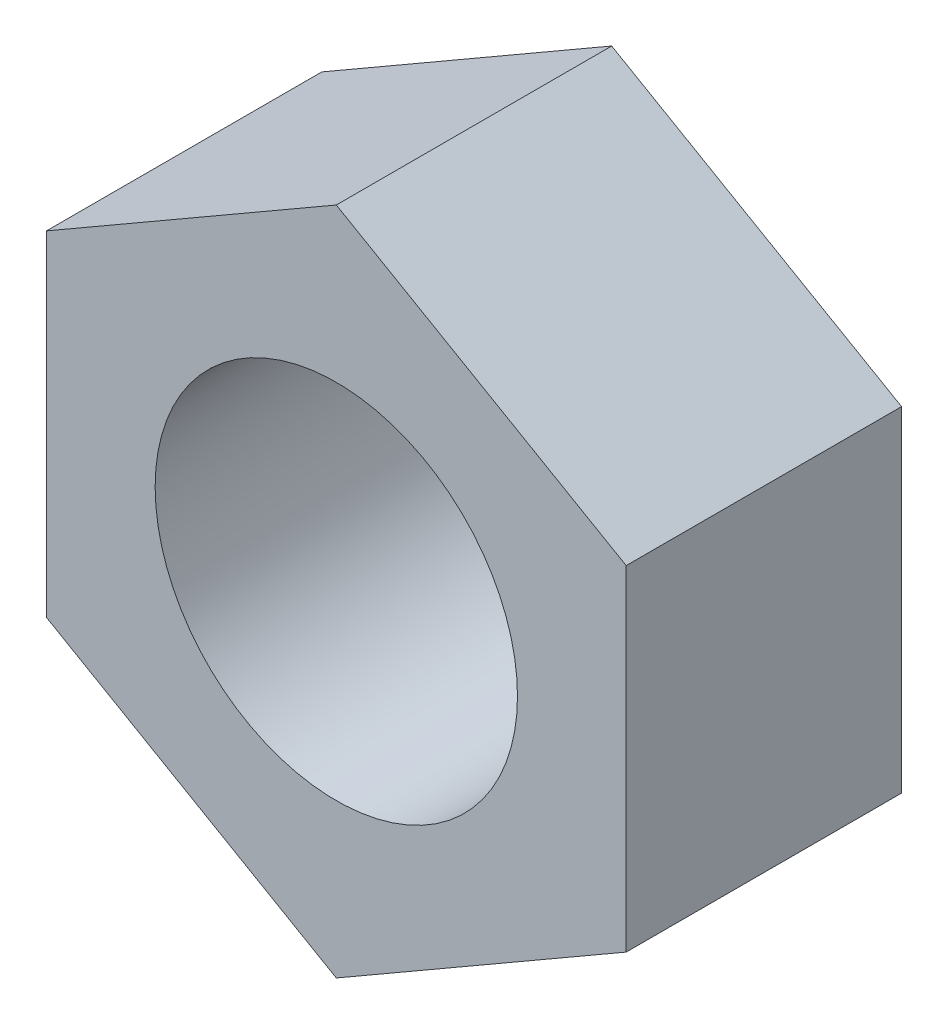
ISO-10303-21;
HEADER;
FILE_DESCRIPTION(('STEP AP214'),'2;1');
FILE_NAME('part.step','',(''),(''),'','','');
FILE_SCHEMA(('AUTOMOTIVE_DESIGN { 1 0 10303 214 1 1 1 1 }'));
ENDSEC;
DATA;
#1=APPLICATION_CONTEXT('core data for automotive mechanical design processes');
#2=APPLICATION_PROTOCOL_DEFINITION('international standard','automotive_design',2000,#1);
#3=PRODUCT_CONTEXT('',#1,'mechanical');
#4=PRODUCT('Part','Part','',(#3));
#5=PRODUCT_RELATED_PRODUCT_CATEGORY('part','',(#4));
#6=PRODUCT_DEFINITION_FORMATION('','',#4);
#7=PRODUCT_DEFINITION_CONTEXT('part definition',#1,'design');
#8=PRODUCT_DEFINITION('design','',#6,#7);
#9=PRODUCT_DEFINITION_SHAPE('','',#8);
#10=(LENGTH_UNIT() NAMED_UNIT(*) SI_UNIT(.MILLI.,.METRE.));
#11=(NAMED_UNIT(*) PLANE_ANGLE_UNIT() SI_UNIT($,.RADIAN.));
#12=(NAMED_UNIT(*) SI_UNIT($,.STERADIAN.) SOLID_ANGLE_UNIT());
#13=UNCERTAINTY_MEASURE_WITH_UNIT(LENGTH_MEASURE(1.E-05),#10,'distance_accuracy_value','');
#14=(GEOMETRIC_REPRESENTATION_CONTEXT(3) GLOBAL_UNCERTAINTY_ASSIGNED_CONTEXT((#13)) GLOBAL_UNIT_ASSIGNED_CONTEXT((#10,
#11,#12)) REPRESENTATION_CONTEXT('',''));
#15=CARTESIAN_POINT('',(0.,0.,0.));
#16=DIRECTION('',(0.,0.,1.));
#17=DIRECTION('',(1.,0.,0.));
#18=AXIS2_PLACEMENT_3D('',#15,#16,#17);
#19=CARTESIAN_POINT('',(0.,0.,3.8));
#20=DIRECTION('',(0.,0.,1.));
#21=DIRECTION('',(1.,0.,0.));
#22=AXIS2_PLACEMENT_3D('',#19,#20,#21);
#23=PLANE('',#22);
#24=DIRECTION('',(-0.866025403784441,0.499999999999995,0.));
#25=VECTOR('',#24,1.);
#26=CARTESIAN_POINT('',(3.99999999999998,2.30940107675855,3.8));
#27=LINE('',#26,#25);
#28=CARTESIAN_POINT('',(3.99999999999998,2.30940107675855,3.8));
#29=VERTEX_POINT('',#28);
#30=CARTESIAN_POINT('',(0.,4.61880215351701,3.8));
#31=VERTEX_POINT('',#30);
#32=EDGE_CURVE('E148',#29,#31,#27,.T.);
#33=ORIENTED_EDGE('',*,*,#32,.T.);
#34=DIRECTION('',(-0.866025403784438,-0.500000000000001,0.));
#35=VECTOR('',#34,1.);
#36=CARTESIAN_POINT('',(0.,4.61880215351701,3.8));
#37=LINE('',#36,#35);
#38=CARTESIAN_POINT('',(-4.00000000000001,2.3094010767585,3.8));
#39=VERTEX_POINT('',#38);
#40=EDGE_CURVE('E94',#31,#39,#37,.T.);
#41=ORIENTED_EDGE('',*,*,#40,.T.);
#42=DIRECTION('',(0.,-1.,0.));
#43=VECTOR('',#42,1.);
#44=CARTESIAN_POINT('',(-4.00000000000001,2.3094010767585,3.8));
#45=LINE('',#44,#43);
#46=CARTESIAN_POINT('',(-3.99999999999999,-2.30940107675852,3.8));
#47=VERTEX_POINT('',#46);
#48=EDGE_CURVE('E107',#39,#47,#45,.T.);
#49=ORIENTED_EDGE('',*,*,#48,.T.);
#50=DIRECTION('',(0.866025403784441,-0.499999999999995,0.));
#51=VECTOR('',#50,1.);
#52=CARTESIAN_POINT('',(-3.99999999999999,-2.30940107675852,3.8));
#53=LINE('',#52,#51);
#54=CARTESIAN_POINT('',(0.,-4.61880215351701,3.8));
#55=VERTEX_POINT('',#54);
#56=EDGE_CURVE('E101',#47,#55,#53,.T.);
#57=ORIENTED_EDGE('',*,*,#56,.T.);
#58=DIRECTION('',(0.866025403784434,0.500000000000007,0.));
#59=VECTOR('',#58,1.);
#60=CARTESIAN_POINT('',(0.,-4.61880215351701,3.8));
#61=LINE('',#60,#59);
#62=CARTESIAN_POINT('',(4.00000000000002,-2.30940107675847,3.8));
#63=VERTEX_POINT('',#62);
#64=EDGE_CURVE('E105',#55,#63,#61,.T.);
#65=ORIENTED_EDGE('',*,*,#64,.T.);
#66=DIRECTION('',(0.,1.,0.));
#67=VECTOR('',#66,1.);
#68=CARTESIAN_POINT('',(4.00000000000002,-2.30940107675847,3.8));
#69=LINE('',#68,#67);
#70=EDGE_CURVE('E57',#63,#29,#69,.T.);
#71=ORIENTED_EDGE('',*,*,#70,.T.);
#72=EDGE_LOOP('',(#33,#41,#49,#57,#65,#71));
#73=FACE_BOUND('',#72,.T.);
#74=CARTESIAN_POINT('',(0.,0.,3.8));
#75=DIRECTION('',(0.,0.,1.));
#76=DIRECTION('',(1.,0.,0.));
#77=AXIS2_PLACEMENT_3D('',#74,#75,#76);
#78=CIRCLE('',#77,2.5);
#79=CARTESIAN_POINT('',(2.5,0.,3.8));
#80=VERTEX_POINT('',#79);
#81=EDGE_CURVE('E137',#80,#80,#78,.T.);
#82=ORIENTED_EDGE('',*,*,#81,.F.);
#83=EDGE_LOOP('',(#82));
#84=FACE_BOUND('',#83,.T.);
#85=ADVANCED_FACE('F39',(#73,#84),#23,.T.);
#86=CARTESIAN_POINT('',(0.,0.,0.));
#87=DIRECTION('',(0.,0.,1.));
#88=DIRECTION('',(1.,0.,0.));
#89=AXIS2_PLACEMENT_3D('',#86,#87,#88);
#90=PLANE('',#89);
#91=DIRECTION('',(-0.866025403784441,0.499999999999995,0.));
#92=VECTOR('',#91,1.);
#93=CARTESIAN_POINT('',(3.99999999999998,2.30940107675855,0.));
#94=LINE('',#93,#92);
#95=CARTESIAN_POINT('',(3.99999999999998,2.30940107675855,0.));
#96=VERTEX_POINT('',#95);
#97=CARTESIAN_POINT('',(0.,4.61880215351701,0.));
#98=VERTEX_POINT('',#97);
#99=EDGE_CURVE('E132',#96,#98,#94,.T.);
#100=ORIENTED_EDGE('',*,*,#99,.F.);
#101=DIRECTION('',(0.,1.,0.));
#102=VECTOR('',#101,1.);
#103=CARTESIAN_POINT('',(4.00000000000002,-2.30940107675847,0.));
#104=LINE('',#103,#102);
#105=CARTESIAN_POINT('',(4.00000000000002,-2.30940107675847,0.));
#106=VERTEX_POINT('',#105);
#107=EDGE_CURVE('E86',#106,#96,#104,.T.);
#108=ORIENTED_EDGE('',*,*,#107,.F.);
#109=DIRECTION('',(0.866025403784434,0.500000000000007,0.));
#110=VECTOR('',#109,1.);
#111=CARTESIAN_POINT('',(0.,-4.61880215351701,0.));
#112=LINE('',#111,#110);
#113=CARTESIAN_POINT('',(0.,-4.61880215351701,0.));
#114=VERTEX_POINT('',#113);
#115=EDGE_CURVE('E80',#114,#106,#112,.T.);
#116=ORIENTED_EDGE('',*,*,#115,.F.);
#117=DIRECTION('',(0.866025403784441,-0.499999999999995,0.));
#118=VECTOR('',#117,1.);
#119=CARTESIAN_POINT('',(-3.99999999999999,-2.30940107675852,0.));
#120=LINE('',#119,#118);
#121=CARTESIAN_POINT('',(-3.99999999999999,-2.30940107675852,0.));
#122=VERTEX_POINT('',#121);
#123=EDGE_CURVE('E116',#122,#114,#120,.T.);
#124=ORIENTED_EDGE('',*,*,#123,.F.);
#125=DIRECTION('',(0.,-1.,0.));
#126=VECTOR('',#125,1.);
#127=CARTESIAN_POINT('',(-4.00000000000001,2.3094010767585,0.));
#128=LINE('',#127,#126);
#129=CARTESIAN_POINT('',(-4.00000000000001,2.3094010767585,0.));
#130=VERTEX_POINT('',#129);
#131=EDGE_CURVE('E140',#130,#122,#128,.T.);
#132=ORIENTED_EDGE('',*,*,#131,.F.);
#133=DIRECTION('',(-0.866025403784438,-0.500000000000001,0.));
#134=VECTOR('',#133,1.);
#135=CARTESIAN_POINT('',(0.,4.61880215351701,0.));
#136=LINE('',#135,#134);
#137=EDGE_CURVE('E136',#98,#130,#136,.T.);
#138=ORIENTED_EDGE('',*,*,#137,.F.);
#139=EDGE_LOOP('',(#100,#108,#116,#124,#132,#138));
#140=FACE_BOUND('',#139,.T.);
#141=CARTESIAN_POINT('',(0.,0.,0.));
#142=DIRECTION('',(0.,0.,1.));
#143=DIRECTION('',(1.,0.,0.));
#144=AXIS2_PLACEMENT_3D('',#141,#142,#143);
#145=CIRCLE('',#144,2.5);
#146=CARTESIAN_POINT('',(2.5,0.,0.));
#147=VERTEX_POINT('',#146);
#148=EDGE_CURVE('E211',#147,#147,#145,.T.);
#149=ORIENTED_EDGE('',*,*,#148,.T.);
#150=EDGE_LOOP('',(#149));
#151=FACE_BOUND('',#150,.T.);
#152=ADVANCED_FACE('F162',(#140,#151),#90,.F.);
#153=CARTESIAN_POINT('',(3.99999999999998,2.30940107675855,3.8));
#154=DIRECTION('',(-0.499999999999995,-0.866025403784441,0.));
#155=DIRECTION('',(0.866025403784441,-0.499999999999995,0.));
#156=AXIS2_PLACEMENT_3D('',#153,#154,#155);
#157=PLANE('',#156);
#158=ORIENTED_EDGE('',*,*,#99,.T.);
#159=DIRECTION('',(0.,0.,-1.));
#160=VECTOR('',#159,1.);
#161=CARTESIAN_POINT('',(0.,4.61880215351701,3.8));
#162=LINE('',#161,#160);
#163=EDGE_CURVE('E11',#31,#98,#162,.T.);
#164=ORIENTED_EDGE('',*,*,#163,.F.);
#165=ORIENTED_EDGE('',*,*,#32,.F.);
#166=DIRECTION('',(0.,0.,-1.));
#167=VECTOR('',#166,1.);
#168=CARTESIAN_POINT('',(3.99999999999998,2.30940107675855,3.8));
#169=LINE('',#168,#167);
#170=EDGE_CURVE('E128',#29,#96,#169,.T.);
#171=ORIENTED_EDGE('',*,*,#170,.T.);
#172=EDGE_LOOP('',(#158,#164,#165,#171));
#173=FACE_BOUND('',#172,.T.);
#174=ADVANCED_FACE('F41',(#173),#157,.F.);
#175=CARTESIAN_POINT('',(0.,4.61880215351701,3.8));
#176=DIRECTION('',(0.500000000000001,-0.866025403784438,0.));
#177=DIRECTION('',(0.866025403784438,0.500000000000001,0.));
#178=AXIS2_PLACEMENT_3D('',#175,#176,#177);
#179=PLANE('',#178);
#180=ORIENTED_EDGE('',*,*,#137,.T.);
#181=DIRECTION('',(0.,0.,-1.));
#182=VECTOR('',#181,1.);
#183=CARTESIAN_POINT('',(-4.00000000000001,2.3094010767585,3.8));
#184=LINE('',#183,#182);
#185=EDGE_CURVE('E49',#39,#130,#184,.T.);
#186=ORIENTED_EDGE('',*,*,#185,.F.);
#187=ORIENTED_EDGE('',*,*,#40,.F.);
#188=ORIENTED_EDGE('',*,*,#163,.T.);
#189=EDGE_LOOP('',(#180,#186,#187,#188));
#190=FACE_BOUND('',#189,.T.);
#191=ADVANCED_FACE('F188',(#190),#179,.F.);
#192=CARTESIAN_POINT('',(-4.00000000000001,2.3094010767585,3.8));
#193=DIRECTION('',(1.,0.,0.));
#194=DIRECTION('',(0.,1.,0.));
#195=AXIS2_PLACEMENT_3D('',#192,#193,#194);
#196=PLANE('',#195);
#197=ORIENTED_EDGE('',*,*,#131,.T.);
#198=DIRECTION('',(0.,0.,-1.));
#199=VECTOR('',#198,1.);
#200=CARTESIAN_POINT('',(-3.99999999999999,-2.30940107675852,3.8));
#201=LINE('',#200,#199);
#202=EDGE_CURVE('E118',#47,#122,#201,.T.);
#203=ORIENTED_EDGE('',*,*,#202,.F.);
#204=ORIENTED_EDGE('',*,*,#48,.F.);
#205=ORIENTED_EDGE('',*,*,#185,.T.);
#206=EDGE_LOOP('',(#197,#203,#204,#205));
#207=FACE_BOUND('',#206,.T.);
#208=ADVANCED_FACE('F159',(#207),#196,.F.);
#209=CARTESIAN_POINT('',(-3.99999999999999,-2.30940107675852,3.8));
#210=DIRECTION('',(0.499999999999995,0.866025403784441,0.));
#211=DIRECTION('',(-0.866025403784442,0.499999999999995,0.));
#212=AXIS2_PLACEMENT_3D('',#209,#210,#211);
#213=PLANE('',#212);
#214=ORIENTED_EDGE('',*,*,#123,.T.);
#215=DIRECTION('',(0.,0.,-1.));
#216=VECTOR('',#215,1.);
#217=CARTESIAN_POINT('',(0.,-4.61880215351701,3.8));
#218=LINE('',#217,#216);
#219=EDGE_CURVE('E113',#55,#114,#218,.T.);
#220=ORIENTED_EDGE('',*,*,#219,.F.);
#221=ORIENTED_EDGE('',*,*,#56,.F.);
#222=ORIENTED_EDGE('',*,*,#202,.T.);
#223=EDGE_LOOP('',(#214,#220,#221,#222));
#224=FACE_BOUND('',#223,.T.);
#225=ADVANCED_FACE('F114',(#224),#213,.F.);
#226=CARTESIAN_POINT('',(0.,-4.61880215351701,3.8));
#227=DIRECTION('',(-0.500000000000007,0.866025403784435,0.));
#228=DIRECTION('',(-0.866025403784435,-0.500000000000007,0.));
#229=AXIS2_PLACEMENT_3D('',#226,#227,#228);
#230=PLANE('',#229);
#231=ORIENTED_EDGE('',*,*,#115,.T.);
#232=DIRECTION('',(0.,0.,-1.));
#233=VECTOR('',#232,1.);
#234=CARTESIAN_POINT('',(4.00000000000002,-2.30940107675847,3.8));
#235=LINE('',#234,#233);
#236=EDGE_CURVE('E119',#63,#106,#235,.T.);
#237=ORIENTED_EDGE('',*,*,#236,.F.);
#238=ORIENTED_EDGE('',*,*,#64,.F.);
#239=ORIENTED_EDGE('',*,*,#219,.T.);
#240=EDGE_LOOP('',(#231,#237,#238,#239));
#241=FACE_BOUND('',#240,.T.);
#242=ADVANCED_FACE('F121',(#241),#230,.F.);
#243=CARTESIAN_POINT('',(4.00000000000002,-2.30940107675847,3.8));
#244=DIRECTION('',(-1.,0.,0.));
#245=DIRECTION('',(0.,-1.,0.));
#246=AXIS2_PLACEMENT_3D('',#243,#244,#245);
#247=PLANE('',#246);
#248=ORIENTED_EDGE('',*,*,#107,.T.);
#249=ORIENTED_EDGE('',*,*,#170,.F.);
#250=ORIENTED_EDGE('',*,*,#70,.F.);
#251=ORIENTED_EDGE('',*,*,#236,.T.);
#252=EDGE_LOOP('',(#248,#249,#250,#251));
#253=FACE_BOUND('',#252,.T.);
#254=ADVANCED_FACE('F167',(#253),#247,.F.);
#255=CARTESIAN_POINT('',(0.,0.,3.8));
#256=DIRECTION('',(0.,0.,-1.));
#257=DIRECTION('',(-1.,0.,0.));
#258=AXIS2_PLACEMENT_3D('',#255,#256,#257);
#259=CYLINDRICAL_SURFACE('',#258,2.5);
#260=ORIENTED_EDGE('',*,*,#81,.T.);
#261=EDGE_LOOP('',(#260));
#262=FACE_BOUND('',#261,.T.);
#263=ORIENTED_EDGE('',*,*,#148,.F.);
#264=EDGE_LOOP('',(#263));
#265=FACE_BOUND('',#264,.T.);
#266=ADVANCED_FACE('F169',(#262,#265),#259,.F.);
#267=CLOSED_SHELL('',(#85,#152,#174,#191,#208,#225,#242,#254,#266));
#268=MANIFOLD_SOLID_BREP('B2',#267);
#269=ADVANCED_BREP_SHAPE_REPRESENTATION('',(#18,#268),#14);
#270=SHAPE_DEFINITION_REPRESENTATION(#9,#269);
ENDSEC;
END-ISO-10303-21;
